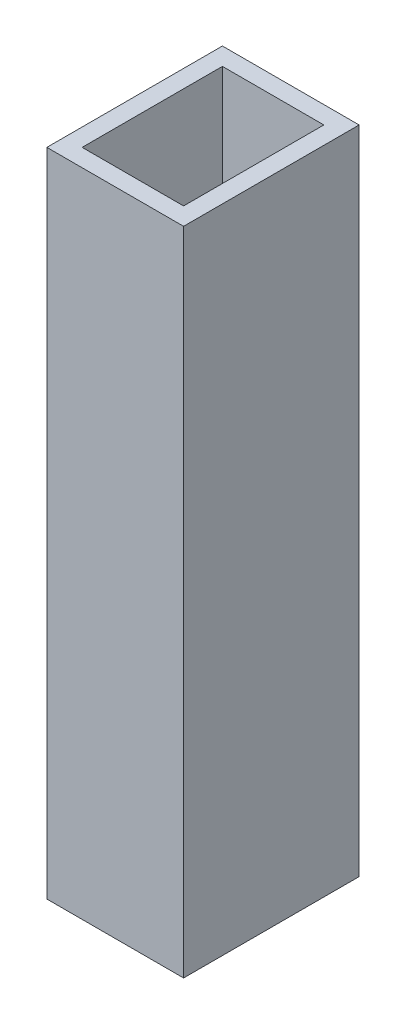
ISO-10303-21;
HEADER;
FILE_DESCRIPTION(('STEP AP214'),'2;1');
FILE_NAME('part.step','',(''),(''),'','','');
FILE_SCHEMA(('AUTOMOTIVE_DESIGN { 1 0 10303 214 1 1 1 1 }'));
ENDSEC;
DATA;
#1=APPLICATION_CONTEXT('core data for automotive mechanical design processes');
#2=APPLICATION_PROTOCOL_DEFINITION('international standard','automotive_design',2000,#1);
#3=PRODUCT_CONTEXT('',#1,'mechanical');
#4=PRODUCT('Part','Part','',(#3));
#5=PRODUCT_RELATED_PRODUCT_CATEGORY('part','',(#4));
#6=PRODUCT_DEFINITION_FORMATION('','',#4);
#7=PRODUCT_DEFINITION_CONTEXT('part definition',#1,'design');
#8=PRODUCT_DEFINITION('design','',#6,#7);
#9=PRODUCT_DEFINITION_SHAPE('','',#8);
#10=(LENGTH_UNIT() NAMED_UNIT(*) SI_UNIT(.MILLI.,.METRE.));
#11=(NAMED_UNIT(*) PLANE_ANGLE_UNIT() SI_UNIT($,.RADIAN.));
#12=(NAMED_UNIT(*) SI_UNIT($,.STERADIAN.) SOLID_ANGLE_UNIT());
#13=UNCERTAINTY_MEASURE_WITH_UNIT(LENGTH_MEASURE(1.E-05),#10,'distance_accuracy_value','');
#14=(GEOMETRIC_REPRESENTATION_CONTEXT(3) GLOBAL_UNCERTAINTY_ASSIGNED_CONTEXT((#13)) GLOBAL_UNIT_ASSIGNED_CONTEXT((#10,
#11,#12)) REPRESENTATION_CONTEXT('',''));
#15=CARTESIAN_POINT('',(0.,0.,0.));
#16=DIRECTION('',(0.,0.,1.));
#17=DIRECTION('',(1.,0.,0.));
#18=AXIS2_PLACEMENT_3D('',#15,#16,#17);
#19=CARTESIAN_POINT('',(-7.13396040015804E-05,-112.600182523003,-0.000896931669353323));
#20=DIRECTION('',(-6.33565615976943E-07,-0.999999999968074,-7.96563246370806E-06));
#21=DIRECTION('',(0.,7.96563246370966E-06,-0.999999999968274));
#22=AXIS2_PLACEMENT_3D('',#19,#20,#21);
#23=PLANE('',#22);
#24=DIRECTION('',(-0.999999999999799,6.33565607416473E-07,1.07719885981208E-09));
#25=VECTOR('',#24,1.);
#26=CARTESIAN_POINT('',(266.322895740023,-112.600239259407,-14.0608816711137));
#27=LINE('',#26,#25);
#28=CARTESIAN_POINT('',(264.322895740024,-112.600237992276,-14.0608816689593));
#29=VERTEX_POINT('',#28);
#30=CARTESIAN_POINT('',(252.82053554914,-112.600230704776,-14.0608816565689));
#31=VERTEX_POINT('',#30);
#32=EDGE_CURVE('E127',#29,#31,#27,.T.);
#33=ORIENTED_EDGE('',*,*,#32,.T.);
#34=DIRECTION('',(-1.07215584480568E-09,7.96563246438894E-06,-0.999999999968274));
#35=VECTOR('',#34,1.);
#36=CARTESIAN_POINT('',(252.820535551284,-112.600246636041,-12.0608816566323));
#37=LINE('',#36,#35);
#38=CARTESIAN_POINT('',(252.820535532087,-112.600104011392,-29.9658816560644));
#39=VERTEX_POINT('',#38);
#40=EDGE_CURVE('E125',#31,#39,#37,.T.);
#41=ORIENTED_EDGE('',*,*,#40,.T.);
#42=DIRECTION('',(0.999999999999799,-6.33565607416478E-07,-1.07719818840132E-09));
#43=VECTOR('',#42,1.);
#44=CARTESIAN_POINT('',(250.820535532087,-112.600102744261,-29.96588165391));
#45=LINE('',#44,#43);
#46=CARTESIAN_POINT('',(264.322895722971,-112.600111298892,-29.9658816684547));
#47=VERTEX_POINT('',#46);
#48=EDGE_CURVE('E138',#39,#47,#45,.T.);
#49=ORIENTED_EDGE('',*,*,#48,.T.);
#50=DIRECTION('',(1.07215026719647E-09,-7.96563246438893E-06,0.999999999968274));
#51=VECTOR('',#50,1.);
#52=CARTESIAN_POINT('',(264.322895720827,-112.600095367627,-31.9658816683912));
#53=LINE('',#52,#51);
#54=EDGE_CURVE('E52',#47,#29,#53,.T.);
#55=ORIENTED_EDGE('',*,*,#54,.T.);
#56=EDGE_LOOP('',(#33,#41,#49,#55));
#57=FACE_BOUND('',#56,.T.);
#58=DIRECTION('',(-1.07215584480568E-09,7.96563246438894E-06,-0.999999999968274));
#59=VECTOR('',#58,1.);
#60=CARTESIAN_POINT('',(250.820535551284,-112.60024536891,-12.060881654478));
#61=LINE('',#60,#59);
#62=CARTESIAN_POINT('',(250.820535551284,-112.60024536891,-12.060881654478));
#63=VERTEX_POINT('',#62);
#64=CARTESIAN_POINT('',(250.820535529943,-112.600086812996,-31.9658816538465));
#65=VERTEX_POINT('',#64);
#66=EDGE_CURVE('E121',#63,#65,#61,.T.);
#67=ORIENTED_EDGE('',*,*,#66,.F.);
#68=DIRECTION('',(-0.999999999999799,6.33565606521278E-07,1.07719885980495E-09));
#69=VECTOR('',#68,1.);
#70=CARTESIAN_POINT('',(266.322895742167,-112.600255190672,-12.0608816711771));
#71=LINE('',#70,#69);
#72=CARTESIAN_POINT('',(266.322895742167,-112.600255190672,-12.0608816711771));
#73=VERTEX_POINT('',#72);
#74=EDGE_CURVE('E150',#73,#63,#71,.T.);
#75=ORIENTED_EDGE('',*,*,#74,.F.);
#76=DIRECTION('',(1.07215026719692E-09,-7.96563246369174E-06,0.999999999968274));
#77=VECTOR('',#76,1.);
#78=CARTESIAN_POINT('',(266.322895720826,-112.600096634758,-31.9658816705456));
#79=LINE('',#78,#77);
#80=CARTESIAN_POINT('',(266.322895720826,-112.600096634758,-31.9658816705456));
#81=VERTEX_POINT('',#80);
#82=EDGE_CURVE('E147',#81,#73,#79,.T.);
#83=ORIENTED_EDGE('',*,*,#82,.F.);
#84=DIRECTION('',(0.999999999999799,-6.33565607416479E-07,-1.07719818840132E-09));
#85=VECTOR('',#84,1.);
#86=CARTESIAN_POINT('',(250.820535529943,-112.600086812996,-31.9658816538465));
#87=LINE('',#86,#85);
#88=EDGE_CURVE('E144',#65,#81,#87,.T.);
#89=ORIENTED_EDGE('',*,*,#88,.F.);
#90=EDGE_LOOP('',(#67,#75,#83,#89));
#91=FACE_BOUND('',#90,.T.);
#92=ADVANCED_FACE('F37',(#57,#91),#23,.F.);
#93=CARTESIAN_POINT('',(266.322832994089,-211.639844915019,-12.0616705841482));
#94=DIRECTION('',(-1.07215210900773E-09,7.96563246382058E-06,-0.999999999968274));
#95=DIRECTION('',(0.,0.999999999968274,7.96563246382058E-06));
#96=AXIS2_PLACEMENT_3D('',#93,#94,#95);
#97=PLANE('',#96);
#98=DIRECTION('',(6.3356561528437E-07,0.999999999968074,7.9656324631397E-06));
#99=VECTOR('',#98,1.);
#100=CARTESIAN_POINT('',(250.820472803206,-211.639835093257,-12.0616705674491));
#101=LINE('',#100,#99);
#102=CARTESIAN_POINT('',(250.820488787802,-186.41024536657,-12.0614695978104));
#103=VERTEX_POINT('',#102);
#104=EDGE_CURVE('E153',#103,#63,#101,.T.);
#105=ORIENTED_EDGE('',*,*,#104,.F.);
#106=DIRECTION('',(0.999999999999799,-6.33565674598892E-07,-1.07719886034724E-09));
#107=VECTOR('',#106,1.);
#108=CARTESIAN_POINT('',(266.322848978691,-186.410255188333,-12.0614696145092));
#109=LINE('',#108,#107);
#110=CARTESIAN_POINT('',(266.322848978689,-186.410255188333,-12.0614696145092));
#111=VERTEX_POINT('',#110);
#112=EDGE_CURVE('E161',#103,#111,#109,.T.);
#113=ORIENTED_EDGE('',*,*,#112,.T.);
#114=DIRECTION('',(6.3356561528437E-07,0.999999999968074,7.9656324631397E-06));
#115=VECTOR('',#114,1.);
#116=CARTESIAN_POINT('',(266.322832994089,-211.639844915019,-12.0616705841482));
#117=LINE('',#116,#115);
#118=EDGE_CURVE('E155',#111,#73,#117,.T.);
#119=ORIENTED_EDGE('',*,*,#118,.T.);
#120=ORIENTED_EDGE('',*,*,#74,.T.);
#121=EDGE_LOOP('',(#105,#113,#119,#120));
#122=FACE_BOUND('',#121,.T.);
#123=ADVANCED_FACE('F178',(#122),#97,.F.);
#124=CARTESIAN_POINT('',(266.322832972748,-211.639686359105,-31.9666705835167));
#125=DIRECTION('',(-0.999999999999799,6.33565606723915E-07,1.07719701799567E-09));
#126=DIRECTION('',(-6.33565606723915E-07,-0.999999999999799,0.));
#127=AXIS2_PLACEMENT_3D('',#124,#125,#126);
#128=PLANE('',#127);
#129=ORIENTED_EDGE('',*,*,#118,.F.);
#130=DIRECTION('',(-1.07215026719463E-09,7.96563246729505E-06,-0.999999999968274));
#131=VECTOR('',#130,1.);
#132=CARTESIAN_POINT('',(266.322848957348,-186.410096632419,-31.9664696138776));
#133=LINE('',#132,#131);
#134=CARTESIAN_POINT('',(266.322848957344,-186.410096632412,-31.966469613878));
#135=VERTEX_POINT('',#134);
#136=EDGE_CURVE('E164',#111,#135,#133,.T.);
#137=ORIENTED_EDGE('',*,*,#136,.T.);
#138=DIRECTION('',(6.3356561528437E-07,0.999999999968074,7.9656324631397E-06));
#139=VECTOR('',#138,1.);
#140=CARTESIAN_POINT('',(266.322832972748,-211.639686359105,-31.9666705835167));
#141=LINE('',#140,#139);
#142=EDGE_CURVE('E157',#135,#81,#141,.T.);
#143=ORIENTED_EDGE('',*,*,#142,.T.);
#144=ORIENTED_EDGE('',*,*,#82,.T.);
#145=EDGE_LOOP('',(#129,#137,#143,#144));
#146=FACE_BOUND('',#145,.T.);
#147=ADVANCED_FACE('F173',(#146),#128,.F.);
#148=CARTESIAN_POINT('',(250.820472781864,-211.639676537343,-31.9666705668176));
#149=DIRECTION('',(1.07215143759696E-09,-7.96563246382058E-06,0.999999999968274));
#150=DIRECTION('',(0.,-0.999999999968274,-7.96563246382058E-06));
#151=AXIS2_PLACEMENT_3D('',#148,#149,#150);
#152=PLANE('',#151);
#153=ORIENTED_EDGE('',*,*,#142,.F.);
#154=DIRECTION('',(-0.999999999999799,6.33565674598897E-07,1.07719818893647E-09));
#155=VECTOR('',#154,1.);
#156=CARTESIAN_POINT('',(250.820488766467,-186.410086810656,-31.9664695971786));
#157=LINE('',#156,#155);
#158=CARTESIAN_POINT('',(250.82048876646,-186.41008681065,-31.9664695971789));
#159=VERTEX_POINT('',#158);
#160=EDGE_CURVE('E45',#135,#159,#157,.T.);
#161=ORIENTED_EDGE('',*,*,#160,.T.);
#162=DIRECTION('',(6.3356561528437E-07,0.999999999968074,7.9656324631397E-06));
#163=VECTOR('',#162,1.);
#164=CARTESIAN_POINT('',(250.820472781864,-211.639676537343,-31.9666705668176));
#165=LINE('',#164,#163);
#166=EDGE_CURVE('E159',#159,#65,#165,.T.);
#167=ORIENTED_EDGE('',*,*,#166,.T.);
#168=ORIENTED_EDGE('',*,*,#88,.T.);
#169=EDGE_LOOP('',(#153,#161,#167,#168));
#170=FACE_BOUND('',#169,.T.);
#171=ADVANCED_FACE('F167',(#170),#152,.F.);
#172=CARTESIAN_POINT('',(250.820472803206,-211.639835093257,-12.0616705674491));
#173=DIRECTION('',(0.999999999999799,-6.33565606723871E-07,-1.07720259560488E-09));
#174=DIRECTION('',(6.33565606723871E-07,0.999999999999799,0.));
#175=AXIS2_PLACEMENT_3D('',#172,#173,#174);
#176=PLANE('',#175);
#177=ORIENTED_EDGE('',*,*,#166,.F.);
#178=DIRECTION('',(1.07215584480384E-09,-7.96563246729505E-06,0.999999999968274));
#179=VECTOR('',#178,1.);
#180=CARTESIAN_POINT('',(250.820488787806,-186.41024536657,-12.06146959781));
#181=LINE('',#180,#179);
#182=EDGE_CURVE('E11',#159,#103,#181,.T.);
#183=ORIENTED_EDGE('',*,*,#182,.T.);
#184=ORIENTED_EDGE('',*,*,#104,.T.);
#185=ORIENTED_EDGE('',*,*,#66,.T.);
#186=EDGE_LOOP('',(#177,#183,#184,#185));
#187=FACE_BOUND('',#186,.T.);
#188=ADVANCED_FACE('F39',(#187),#176,.F.);
#189=CARTESIAN_POINT('',(180.566645733364,-186.410017508234,-35.0788398528034));
#190=DIRECTION('',(6.33565683159361E-07,0.999999999968074,7.96563246661417E-06));
#191=DIRECTION('',(0.,-7.96563246661577E-06,0.999999999968274));
#192=AXIS2_PLACEMENT_3D('',#189,#190,#191);
#193=PLANE('',#192);
#194=ORIENTED_EDGE('',*,*,#136,.F.);
#195=ORIENTED_EDGE('',*,*,#112,.F.);
#196=ORIENTED_EDGE('',*,*,#182,.F.);
#197=ORIENTED_EDGE('',*,*,#160,.F.);
#198=EDGE_LOOP('',(#194,#195,#196,#197));
#199=FACE_BOUND('',#198,.T.);
#200=ADVANCED_FACE('F174',(#199),#193,.F.);
#201=CARTESIAN_POINT('',(266.322832991945,-211.639828983754,-14.0616705840847));
#202=DIRECTION('',(-1.07215210900773E-09,7.96563246382058E-06,-0.999999999968274));
#203=DIRECTION('',(0.,0.999999999968274,7.96563246382058E-06));
#204=AXIS2_PLACEMENT_3D('',#201,#202,#203);
#205=PLANE('',#204);
#206=DIRECTION('',(6.3356561528437E-07,0.999999999968074,7.9656324631397E-06));
#207=VECTOR('',#206,1.);
#208=CARTESIAN_POINT('',(252.820472801061,-211.639820429123,-14.06167056954));
#209=LINE('',#208,#207);
#210=CARTESIAN_POINT('',(252.820490052793,-184.4102307025,-14.0614536686361));
#211=VERTEX_POINT('',#210);
#212=EDGE_CURVE('E107',#211,#31,#209,.T.);
#213=ORIENTED_EDGE('',*,*,#212,.T.);
#214=ORIENTED_EDGE('',*,*,#32,.F.);
#215=DIRECTION('',(6.3356561528437E-07,0.999999999968074,7.9656324631397E-06));
#216=VECTOR('',#215,1.);
#217=CARTESIAN_POINT('',(264.322832991945,-211.639827716623,-14.0616705819303));
#218=LINE('',#217,#216);
#219=CARTESIAN_POINT('',(264.322850243677,-184.410237990001,-14.0614536810264));
#220=VERTEX_POINT('',#219);
#221=EDGE_CURVE('E109',#220,#29,#218,.T.);
#222=ORIENTED_EDGE('',*,*,#221,.F.);
#223=DIRECTION('',(0.999999999999799,-6.33565674598892E-07,-1.07719886034724E-09));
#224=VECTOR('',#223,1.);
#225=CARTESIAN_POINT('',(266.322850243678,-184.410239257132,-14.0614536831808));
#226=LINE('',#225,#224);
#227=EDGE_CURVE('E102',#211,#220,#226,.T.);
#228=ORIENTED_EDGE('',*,*,#227,.F.);
#229=EDGE_LOOP('',(#213,#214,#222,#228));
#230=FACE_BOUND('',#229,.T.);
#231=ADVANCED_FACE('F104',(#230),#205,.T.);
#232=CARTESIAN_POINT('',(264.322832972748,-211.639685091974,-31.9666705813623));
#233=DIRECTION('',(-0.999999999999799,6.33565606723915E-07,1.07719701799567E-09));
#234=DIRECTION('',(-6.33565606723915E-07,-0.999999999999799,0.));
#235=AXIS2_PLACEMENT_3D('',#232,#233,#234);
#236=PLANE('',#235);
#237=ORIENTED_EDGE('',*,*,#221,.T.);
#238=ORIENTED_EDGE('',*,*,#54,.F.);
#239=DIRECTION('',(6.3356561528437E-07,0.999999999968074,7.9656324631397E-06));
#240=VECTOR('',#239,1.);
#241=CARTESIAN_POINT('',(264.322832974892,-211.639701023239,-29.9666705814258));
#242=LINE('',#241,#240);
#243=CARTESIAN_POINT('',(264.322850226624,-184.410111296617,-29.9664536805219));
#244=VERTEX_POINT('',#243);
#245=EDGE_CURVE('E129',#244,#47,#242,.T.);
#246=ORIENTED_EDGE('',*,*,#245,.F.);
#247=DIRECTION('',(-1.07215026719463E-09,7.96563246729505E-06,-0.999999999968274));
#248=VECTOR('',#247,1.);
#249=CARTESIAN_POINT('',(264.32285022448,-184.410095365352,-31.9664536804583));
#250=LINE('',#249,#248);
#251=EDGE_CURVE('E112',#220,#244,#250,.T.);
#252=ORIENTED_EDGE('',*,*,#251,.F.);
#253=EDGE_LOOP('',(#237,#238,#246,#252));
#254=FACE_BOUND('',#253,.T.);
#255=ADVANCED_FACE('F203',(#254),#236,.T.);
#256=CARTESIAN_POINT('',(250.820472784009,-211.639692468608,-29.966670566881));
#257=DIRECTION('',(1.07215143759696E-09,-7.96563246382058E-06,0.999999999968274));
#258=DIRECTION('',(0.,-0.999999999968274,-7.96563246382058E-06));
#259=AXIS2_PLACEMENT_3D('',#256,#257,#258);
#260=PLANE('',#259);
#261=ORIENTED_EDGE('',*,*,#245,.T.);
#262=ORIENTED_EDGE('',*,*,#48,.F.);
#263=DIRECTION('',(6.3356561528437E-07,0.999999999968074,7.9656324631397E-06));
#264=VECTOR('',#263,1.);
#265=CARTESIAN_POINT('',(252.820472784008,-211.639693735739,-29.9666705690354));
#266=LINE('',#265,#264);
#267=CARTESIAN_POINT('',(252.82049003574,-184.410104009116,-29.9664536681315));
#268=VERTEX_POINT('',#267);
#269=EDGE_CURVE('E113',#268,#39,#266,.T.);
#270=ORIENTED_EDGE('',*,*,#269,.F.);
#271=DIRECTION('',(-0.999999999999799,6.33565674598897E-07,1.07719818893647E-09));
#272=VECTOR('',#271,1.);
#273=CARTESIAN_POINT('',(250.820490035742,-184.410102741985,-29.9664536659771));
#274=LINE('',#273,#272);
#275=EDGE_CURVE('E118',#244,#268,#274,.T.);
#276=ORIENTED_EDGE('',*,*,#275,.F.);
#277=EDGE_LOOP('',(#261,#262,#270,#276));
#278=FACE_BOUND('',#277,.T.);
#279=ADVANCED_FACE('F208',(#278),#260,.T.);
#280=CARTESIAN_POINT('',(252.820472803205,-211.639836360388,-12.0616705696035));
#281=DIRECTION('',(0.999999999999799,-6.33565606723871E-07,-1.07720259560488E-09));
#282=DIRECTION('',(6.33565606723871E-07,0.999999999999799,0.));
#283=AXIS2_PLACEMENT_3D('',#280,#281,#282);
#284=PLANE('',#283);
#285=ORIENTED_EDGE('',*,*,#269,.T.);
#286=ORIENTED_EDGE('',*,*,#40,.F.);
#287=ORIENTED_EDGE('',*,*,#212,.F.);
#288=DIRECTION('',(1.07215584480384E-09,-7.96563246729505E-06,0.999999999968274));
#289=VECTOR('',#288,1.);
#290=CARTESIAN_POINT('',(252.820490054937,-184.410246633765,-12.0614536686995));
#291=LINE('',#290,#289);
#292=EDGE_CURVE('E116',#268,#211,#291,.T.);
#293=ORIENTED_EDGE('',*,*,#292,.F.);
#294=EDGE_LOOP('',(#285,#286,#287,#293));
#295=FACE_BOUND('',#294,.T.);
#296=ADVANCED_FACE('F123',(#295),#284,.T.);
#297=CARTESIAN_POINT('',(180.566647000495,-184.410017508298,-35.0788239215385));
#298=DIRECTION('',(6.33565683159361E-07,0.999999999968074,7.96563246661417E-06));
#299=DIRECTION('',(0.,-7.96563246661577E-06,0.999999999968274));
#300=AXIS2_PLACEMENT_3D('',#297,#298,#299);
#301=PLANE('',#300);
#302=ORIENTED_EDGE('',*,*,#251,.T.);
#303=ORIENTED_EDGE('',*,*,#275,.T.);
#304=ORIENTED_EDGE('',*,*,#292,.T.);
#305=ORIENTED_EDGE('',*,*,#227,.T.);
#306=EDGE_LOOP('',(#302,#303,#304,#305));
#307=FACE_BOUND('',#306,.T.);
#308=ADVANCED_FACE('F117',(#307),#301,.T.);
#309=CLOSED_SHELL('',(#92,#123,#147,#171,#188,#200,#231,#255,#279,#296,#308));
#310=MANIFOLD_SOLID_BREP('B2',#309);
#311=ADVANCED_BREP_SHAPE_REPRESENTATION('',(#18,#310),#14);
#312=SHAPE_DEFINITION_REPRESENTATION(#9,#311);
ENDSEC;
END-ISO-10303-21;
